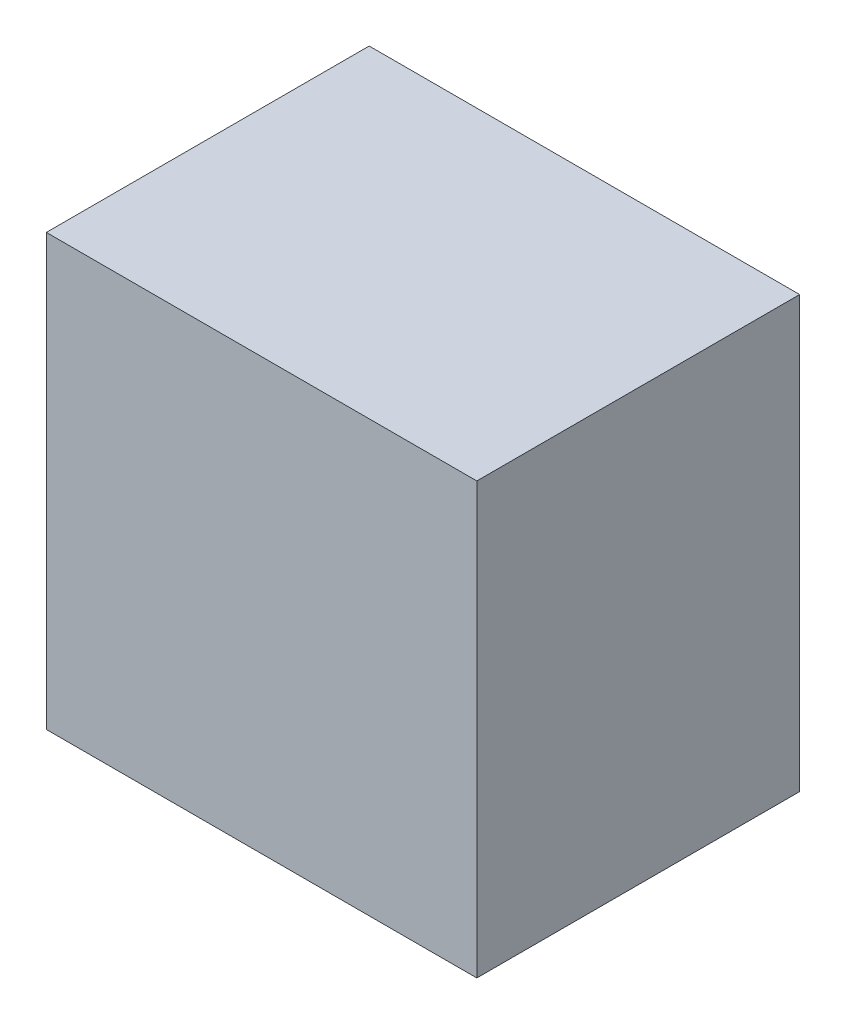
ISO-10303-21;
HEADER;
FILE_DESCRIPTION(('STEP AP214'),'2;1');
FILE_NAME('part.step','',(''),(''),'','','');
FILE_SCHEMA(('AUTOMOTIVE_DESIGN { 1 0 10303 214 1 1 1 1 }'));
ENDSEC;
DATA;
#1=APPLICATION_CONTEXT('core data for automotive mechanical design processes');
#2=APPLICATION_PROTOCOL_DEFINITION('international standard','automotive_design',2000,#1);
#3=PRODUCT_CONTEXT('',#1,'mechanical');
#4=PRODUCT('Part','Part','',(#3));
#5=PRODUCT_RELATED_PRODUCT_CATEGORY('part','',(#4));
#6=PRODUCT_DEFINITION_FORMATION('','',#4);
#7=PRODUCT_DEFINITION_CONTEXT('part definition',#1,'design');
#8=PRODUCT_DEFINITION('design','',#6,#7);
#9=PRODUCT_DEFINITION_SHAPE('','',#8);
#10=(LENGTH_UNIT() NAMED_UNIT(*) SI_UNIT(.MILLI.,.METRE.));
#11=(NAMED_UNIT(*) PLANE_ANGLE_UNIT() SI_UNIT($,.RADIAN.));
#12=(NAMED_UNIT(*) SI_UNIT($,.STERADIAN.) SOLID_ANGLE_UNIT());
#13=UNCERTAINTY_MEASURE_WITH_UNIT(LENGTH_MEASURE(1.E-05),#10,'distance_accuracy_value','');
#14=(GEOMETRIC_REPRESENTATION_CONTEXT(3) GLOBAL_UNCERTAINTY_ASSIGNED_CONTEXT((#13)) GLOBAL_UNIT_ASSIGNED_CONTEXT((#10,
#11,#12)) REPRESENTATION_CONTEXT('',''));
#15=CARTESIAN_POINT('',(0.,0.,0.));
#16=DIRECTION('',(0.,0.,1.));
#17=DIRECTION('',(1.,0.,0.));
#18=AXIS2_PLACEMENT_3D('',#15,#16,#17);
#19=CARTESIAN_POINT('',(10.,-10.,15.));
#20=DIRECTION('',(-1.,0.,0.));
#21=DIRECTION('',(0.,0.,1.));
#22=AXIS2_PLACEMENT_3D('',#19,#20,#21);
#23=PLANE('',#22);
#24=DIRECTION('',(0.,1.,0.));
#25=VECTOR('',#24,1.);
#26=CARTESIAN_POINT('',(10.,-10.,0.));
#27=LINE('',#26,#25);
#28=CARTESIAN_POINT('',(10.,-10.,0.));
#29=VERTEX_POINT('',#28);
#30=CARTESIAN_POINT('',(10.,10.,0.));
#31=VERTEX_POINT('',#30);
#32=EDGE_CURVE('E95',#29,#31,#27,.T.);
#33=ORIENTED_EDGE('',*,*,#32,.T.);
#34=DIRECTION('',(0.,0.,-1.));
#35=VECTOR('',#34,1.);
#36=CARTESIAN_POINT('',(10.,10.,15.));
#37=LINE('',#36,#35);
#38=CARTESIAN_POINT('',(10.,10.,15.));
#39=VERTEX_POINT('',#38);
#40=EDGE_CURVE('E11',#39,#31,#37,.T.);
#41=ORIENTED_EDGE('',*,*,#40,.F.);
#42=DIRECTION('',(0.,1.,0.));
#43=VECTOR('',#42,1.);
#44=CARTESIAN_POINT('',(10.,-10.,15.));
#45=LINE('',#44,#43);
#46=CARTESIAN_POINT('',(10.,-10.,15.));
#47=VERTEX_POINT('',#46);
#48=EDGE_CURVE('E83',#47,#39,#45,.T.);
#49=ORIENTED_EDGE('',*,*,#48,.F.);
#50=DIRECTION('',(0.,0.,-1.));
#51=VECTOR('',#50,1.);
#52=CARTESIAN_POINT('',(10.,-10.,15.));
#53=LINE('',#52,#51);
#54=EDGE_CURVE('E91',#47,#29,#53,.T.);
#55=ORIENTED_EDGE('',*,*,#54,.T.);
#56=EDGE_LOOP('',(#33,#41,#49,#55));
#57=FACE_BOUND('',#56,.T.);
#58=ADVANCED_FACE('F32',(#57),#23,.F.);
#59=CARTESIAN_POINT('',(10.,10.,15.));
#60=DIRECTION('',(0.,-1.,0.));
#61=DIRECTION('',(0.,0.,-1.));
#62=AXIS2_PLACEMENT_3D('',#59,#60,#61);
#63=PLANE('',#62);
#64=DIRECTION('',(-1.,0.,0.));
#65=VECTOR('',#64,1.);
#66=CARTESIAN_POINT('',(10.,10.,0.));
#67=LINE('',#66,#65);
#68=CARTESIAN_POINT('',(-10.,10.,0.));
#69=VERTEX_POINT('',#68);
#70=EDGE_CURVE('E87',#31,#69,#67,.T.);
#71=ORIENTED_EDGE('',*,*,#70,.T.);
#72=DIRECTION('',(0.,0.,-1.));
#73=VECTOR('',#72,1.);
#74=CARTESIAN_POINT('',(-10.,10.,15.));
#75=LINE('',#74,#73);
#76=CARTESIAN_POINT('',(-10.,10.,15.));
#77=VERTEX_POINT('',#76);
#78=EDGE_CURVE('E40',#77,#69,#75,.T.);
#79=ORIENTED_EDGE('',*,*,#78,.F.);
#80=DIRECTION('',(-1.,0.,0.));
#81=VECTOR('',#80,1.);
#82=CARTESIAN_POINT('',(10.,10.,15.));
#83=LINE('',#82,#81);
#84=EDGE_CURVE('E78',#39,#77,#83,.T.);
#85=ORIENTED_EDGE('',*,*,#84,.F.);
#86=ORIENTED_EDGE('',*,*,#40,.T.);
#87=EDGE_LOOP('',(#71,#79,#85,#86));
#88=FACE_BOUND('',#87,.T.);
#89=ADVANCED_FACE('F86',(#88),#63,.F.);
#90=CARTESIAN_POINT('',(-10.,10.,15.));
#91=DIRECTION('',(1.,0.,0.));
#92=DIRECTION('',(0.,0.,-1.));
#93=AXIS2_PLACEMENT_3D('',#90,#91,#92);
#94=PLANE('',#93);
#95=DIRECTION('',(0.,-1.,0.));
#96=VECTOR('',#95,1.);
#97=CARTESIAN_POINT('',(-10.,10.,0.));
#98=LINE('',#97,#96);
#99=CARTESIAN_POINT('',(-10.,-10.,0.));
#100=VERTEX_POINT('',#99);
#101=EDGE_CURVE('E65',#69,#100,#98,.T.);
#102=ORIENTED_EDGE('',*,*,#101,.T.);
#103=DIRECTION('',(0.,0.,-1.));
#104=VECTOR('',#103,1.);
#105=CARTESIAN_POINT('',(-10.,-10.,15.));
#106=LINE('',#105,#104);
#107=CARTESIAN_POINT('',(-10.,-10.,15.));
#108=VERTEX_POINT('',#107);
#109=EDGE_CURVE('E88',#108,#100,#106,.T.);
#110=ORIENTED_EDGE('',*,*,#109,.F.);
#111=DIRECTION('',(0.,-1.,0.));
#112=VECTOR('',#111,1.);
#113=CARTESIAN_POINT('',(-10.,10.,15.));
#114=LINE('',#113,#112);
#115=EDGE_CURVE('E81',#77,#108,#114,.T.);
#116=ORIENTED_EDGE('',*,*,#115,.F.);
#117=ORIENTED_EDGE('',*,*,#78,.T.);
#118=EDGE_LOOP('',(#102,#110,#116,#117));
#119=FACE_BOUND('',#118,.T.);
#120=ADVANCED_FACE('F89',(#119),#94,.F.);
#121=CARTESIAN_POINT('',(-10.,-10.,15.));
#122=DIRECTION('',(0.,1.,0.));
#123=DIRECTION('',(0.,0.,1.));
#124=AXIS2_PLACEMENT_3D('',#121,#122,#123);
#125=PLANE('',#124);
#126=DIRECTION('',(1.,0.,0.));
#127=VECTOR('',#126,1.);
#128=CARTESIAN_POINT('',(-10.,-10.,0.));
#129=LINE('',#128,#127);
#130=EDGE_CURVE('E71',#100,#29,#129,.T.);
#131=ORIENTED_EDGE('',*,*,#130,.T.);
#132=ORIENTED_EDGE('',*,*,#54,.F.);
#133=DIRECTION('',(1.,0.,0.));
#134=VECTOR('',#133,1.);
#135=CARTESIAN_POINT('',(-10.,-10.,15.));
#136=LINE('',#135,#134);
#137=EDGE_CURVE('E48',#108,#47,#136,.T.);
#138=ORIENTED_EDGE('',*,*,#137,.F.);
#139=ORIENTED_EDGE('',*,*,#109,.T.);
#140=EDGE_LOOP('',(#131,#132,#138,#139));
#141=FACE_BOUND('',#140,.T.);
#142=ADVANCED_FACE('F102',(#141),#125,.F.);
#143=CARTESIAN_POINT('',(0.,0.,15.));
#144=DIRECTION('',(0.,0.,1.));
#145=DIRECTION('',(1.,0.,0.));
#146=AXIS2_PLACEMENT_3D('',#143,#144,#145);
#147=PLANE('',#146);
#148=ORIENTED_EDGE('',*,*,#48,.T.);
#149=ORIENTED_EDGE('',*,*,#84,.T.);
#150=ORIENTED_EDGE('',*,*,#115,.T.);
#151=ORIENTED_EDGE('',*,*,#137,.T.);
#152=EDGE_LOOP('',(#148,#149,#150,#151));
#153=FACE_BOUND('',#152,.T.);
#154=ADVANCED_FACE('F79',(#153),#147,.T.);
#155=CARTESIAN_POINT('',(0.,0.,0.));
#156=DIRECTION('',(0.,0.,1.));
#157=DIRECTION('',(1.,0.,0.));
#158=AXIS2_PLACEMENT_3D('',#155,#156,#157);
#159=PLANE('',#158);
#160=ORIENTED_EDGE('',*,*,#32,.F.);
#161=ORIENTED_EDGE('',*,*,#130,.F.);
#162=ORIENTED_EDGE('',*,*,#101,.F.);
#163=ORIENTED_EDGE('',*,*,#70,.F.);
#164=EDGE_LOOP('',(#160,#161,#162,#163));
#165=FACE_BOUND('',#164,.T.);
#166=ADVANCED_FACE('F105',(#165),#159,.F.);
#167=CLOSED_SHELL('',(#58,#89,#120,#142,#154,#166));
#168=MANIFOLD_SOLID_BREP('B2',#167);
#169=ADVANCED_BREP_SHAPE_REPRESENTATION('',(#18,#168),#14);
#170=SHAPE_DEFINITION_REPRESENTATION(#9,#169);
ENDSEC;
END-ISO-10303-21;
